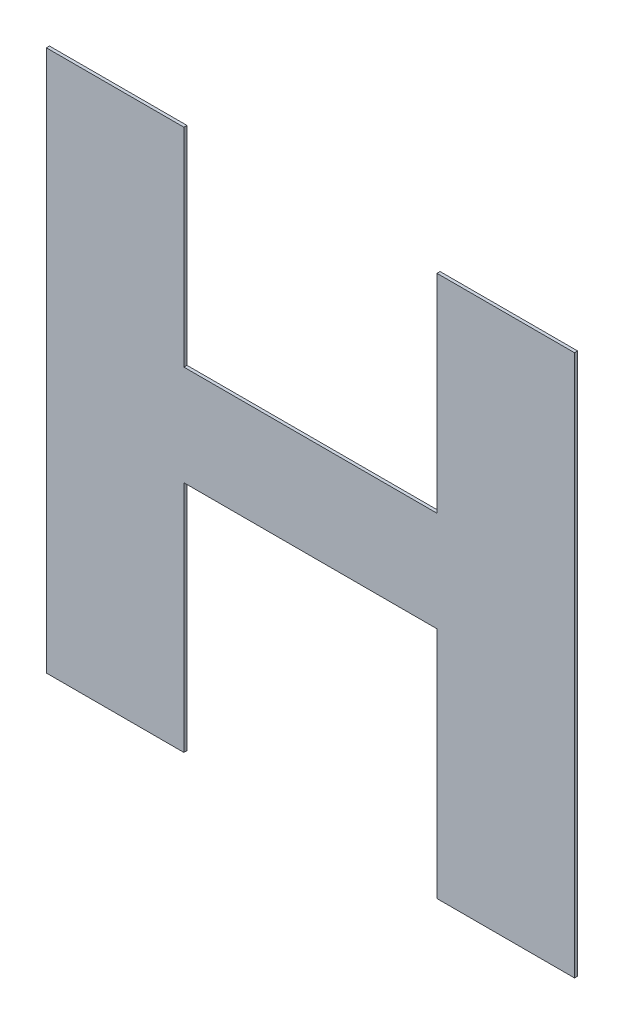
ISO-10303-21;
HEADER;
FILE_DESCRIPTION(('STEP AP214'),'2;1');
FILE_NAME('part.step','',(''),(''),'','','');
FILE_SCHEMA(('AUTOMOTIVE_DESIGN { 1 0 10303 214 1 1 1 1 }'));
ENDSEC;
DATA;
#1=APPLICATION_CONTEXT('core data for automotive mechanical design processes');
#2=APPLICATION_PROTOCOL_DEFINITION('international standard','automotive_design',2000,#1);
#3=PRODUCT_CONTEXT('',#1,'mechanical');
#4=PRODUCT('Part','Part','',(#3));
#5=PRODUCT_RELATED_PRODUCT_CATEGORY('part','',(#4));
#6=PRODUCT_DEFINITION_FORMATION('','',#4);
#7=PRODUCT_DEFINITION_CONTEXT('part definition',#1,'design');
#8=PRODUCT_DEFINITION('design','',#6,#7);
#9=PRODUCT_DEFINITION_SHAPE('','',#8);
#10=(LENGTH_UNIT() NAMED_UNIT(*) SI_UNIT(.MILLI.,.METRE.));
#11=(NAMED_UNIT(*) PLANE_ANGLE_UNIT() SI_UNIT($,.RADIAN.));
#12=(NAMED_UNIT(*) SI_UNIT($,.STERADIAN.) SOLID_ANGLE_UNIT());
#13=UNCERTAINTY_MEASURE_WITH_UNIT(LENGTH_MEASURE(1.E-05),#10,'distance_accuracy_value','');
#14=(GEOMETRIC_REPRESENTATION_CONTEXT(3) GLOBAL_UNCERTAINTY_ASSIGNED_CONTEXT((#13)) GLOBAL_UNIT_ASSIGNED_CONTEXT((#10,
#11,#12)) REPRESENTATION_CONTEXT('',''));
#15=CARTESIAN_POINT('',(0.,0.,0.));
#16=DIRECTION('',(0.,0.,1.));
#17=DIRECTION('',(1.,0.,0.));
#18=AXIS2_PLACEMENT_3D('',#15,#16,#17);
#19=CARTESIAN_POINT('',(-0.0483721960073377,0.92595557828035,0.00015));
#20=DIRECTION('',(0.,1.,0.));
#21=DIRECTION('',(0.,0.,1.));
#22=AXIS2_PLACEMENT_3D('',#19,#20,#21);
#23=PLANE('',#22);
#24=DIRECTION('',(0.,0.,1.));
#25=VECTOR('',#24,1.);
#26=CARTESIAN_POINT('',(-0.0517065037490002,0.92595557828035,0.));
#27=LINE('',#26,#25);
#28=CARTESIAN_POINT('',(-0.0517065037490002,0.92595557828035,0.));
#29=VERTEX_POINT('',#28);
#30=CARTESIAN_POINT('',(-0.0517065037490002,0.92595557828035,0.00015));
#31=VERTEX_POINT('',#30);
#32=EDGE_CURVE('E11',#29,#31,#27,.T.);
#33=ORIENTED_EDGE('',*,*,#32,.T.);
#34=DIRECTION('',(1.,0.,0.));
#35=VECTOR('',#34,1.);
#36=CARTESIAN_POINT('',(-0.0517065037490002,0.92595557828035,0.00015));
#37=LINE('',#36,#35);
#38=CARTESIAN_POINT('',(-0.0450378882656752,0.92595557828035,0.00015));
#39=VERTEX_POINT('',#38);
#40=EDGE_CURVE('E24',#31,#39,#37,.T.);
#41=ORIENTED_EDGE('',*,*,#40,.T.);
#42=DIRECTION('',(0.,0.,1.));
#43=VECTOR('',#42,1.);
#44=CARTESIAN_POINT('',(-0.0450378882656752,0.92595557828035,0.));
#45=LINE('',#44,#43);
#46=CARTESIAN_POINT('',(-0.0450378882656752,0.92595557828035,0.));
#47=VERTEX_POINT('',#46);
#48=EDGE_CURVE('E197',#47,#39,#45,.T.);
#49=ORIENTED_EDGE('',*,*,#48,.F.);
#50=DIRECTION('',(1.,0.,0.));
#51=VECTOR('',#50,1.);
#52=CARTESIAN_POINT('',(-0.0517065037490002,0.92595557828035,0.));
#53=LINE('',#52,#51);
#54=EDGE_CURVE('E195',#29,#47,#53,.T.);
#55=ORIENTED_EDGE('',*,*,#54,.F.);
#56=EDGE_LOOP('',(#33,#41,#49,#55));
#57=FACE_BOUND('',#56,.T.);
#58=ADVANCED_FACE('F17',(#57),#23,.T.);
#59=CARTESIAN_POINT('',(-0.0450378882656752,0.920917038594508,0.00015));
#60=DIRECTION('',(1.,0.,0.));
#61=DIRECTION('',(0.,0.,-1.));
#62=AXIS2_PLACEMENT_3D('',#59,#60,#61);
#63=PLANE('',#62);
#64=ORIENTED_EDGE('',*,*,#48,.T.);
#65=DIRECTION('',(0.,-1.,0.));
#66=VECTOR('',#65,1.);
#67=CARTESIAN_POINT('',(-0.0450378882656752,0.92595557828035,0.00015));
#68=LINE('',#67,#66);
#69=CARTESIAN_POINT('',(-0.0450378882656752,0.915878498908667,0.00015));
#70=VERTEX_POINT('',#69);
#71=EDGE_CURVE('E193',#39,#70,#68,.T.);
#72=ORIENTED_EDGE('',*,*,#71,.T.);
#73=DIRECTION('',(0.,0.,1.));
#74=VECTOR('',#73,1.);
#75=CARTESIAN_POINT('',(-0.0450378882656752,0.915878498908667,0.));
#76=LINE('',#75,#74);
#77=CARTESIAN_POINT('',(-0.0450378882656752,0.915878498908667,0.));
#78=VERTEX_POINT('',#77);
#79=EDGE_CURVE('E190',#78,#70,#76,.T.);
#80=ORIENTED_EDGE('',*,*,#79,.F.);
#81=DIRECTION('',(0.,-1.,0.));
#82=VECTOR('',#81,1.);
#83=CARTESIAN_POINT('',(-0.0450378882656752,0.92595557828035,0.));
#84=LINE('',#83,#82);
#85=EDGE_CURVE('E187',#47,#78,#84,.T.);
#86=ORIENTED_EDGE('',*,*,#85,.F.);
#87=EDGE_LOOP('',(#64,#72,#80,#86));
#88=FACE_BOUND('',#87,.T.);
#89=ADVANCED_FACE('F203',(#88),#63,.T.);
#90=CARTESIAN_POINT('',(-0.0388988606656627,0.915878498908667,0.00015));
#91=DIRECTION('',(0.,1.,0.));
#92=DIRECTION('',(0.,0.,1.));
#93=AXIS2_PLACEMENT_3D('',#90,#91,#92);
#94=PLANE('',#93);
#95=ORIENTED_EDGE('',*,*,#79,.T.);
#96=DIRECTION('',(1.,0.,0.));
#97=VECTOR('',#96,1.);
#98=CARTESIAN_POINT('',(-0.0450378882656752,0.915878498908667,0.00015));
#99=LINE('',#98,#97);
#100=CARTESIAN_POINT('',(-0.0327598330656502,0.915878498908667,0.00015));
#101=VERTEX_POINT('',#100);
#102=EDGE_CURVE('E185',#70,#101,#99,.T.);
#103=ORIENTED_EDGE('',*,*,#102,.T.);
#104=DIRECTION('',(0.,0.,1.));
#105=VECTOR('',#104,1.);
#106=CARTESIAN_POINT('',(-0.0327598330656502,0.915878498908667,0.));
#107=LINE('',#106,#105);
#108=CARTESIAN_POINT('',(-0.0327598330656502,0.915878498908667,0.));
#109=VERTEX_POINT('',#108);
#110=EDGE_CURVE('E182',#109,#101,#107,.T.);
#111=ORIENTED_EDGE('',*,*,#110,.F.);
#112=DIRECTION('',(1.,0.,0.));
#113=VECTOR('',#112,1.);
#114=CARTESIAN_POINT('',(-0.0450378882656752,0.915878498908667,0.));
#115=LINE('',#114,#113);
#116=EDGE_CURVE('E179',#78,#109,#115,.T.);
#117=ORIENTED_EDGE('',*,*,#116,.F.);
#118=EDGE_LOOP('',(#95,#103,#111,#117));
#119=FACE_BOUND('',#118,.T.);
#120=ADVANCED_FACE('F209',(#119),#94,.T.);
#121=CARTESIAN_POINT('',(-0.0327598330656502,0.920917038594508,0.00015));
#122=DIRECTION('',(-1.,0.,0.));
#123=DIRECTION('',(0.,0.,1.));
#124=AXIS2_PLACEMENT_3D('',#121,#122,#123);
#125=PLANE('',#124);
#126=ORIENTED_EDGE('',*,*,#110,.T.);
#127=DIRECTION('',(0.,1.,0.));
#128=VECTOR('',#127,1.);
#129=CARTESIAN_POINT('',(-0.0327598330656502,0.915878498908667,0.00015));
#130=LINE('',#129,#128);
#131=CARTESIAN_POINT('',(-0.0327598330656502,0.92595557828035,0.00015));
#132=VERTEX_POINT('',#131);
#133=EDGE_CURVE('E177',#101,#132,#130,.T.);
#134=ORIENTED_EDGE('',*,*,#133,.T.);
#135=DIRECTION('',(0.,0.,1.));
#136=VECTOR('',#135,1.);
#137=CARTESIAN_POINT('',(-0.0327598330656502,0.92595557828035,0.));
#138=LINE('',#137,#136);
#139=CARTESIAN_POINT('',(-0.0327598330656502,0.92595557828035,0.));
#140=VERTEX_POINT('',#139);
#141=EDGE_CURVE('E174',#140,#132,#138,.T.);
#142=ORIENTED_EDGE('',*,*,#141,.F.);
#143=DIRECTION('',(0.,1.,0.));
#144=VECTOR('',#143,1.);
#145=CARTESIAN_POINT('',(-0.0327598330656502,0.915878498908667,0.));
#146=LINE('',#145,#144);
#147=EDGE_CURVE('E171',#109,#140,#146,.T.);
#148=ORIENTED_EDGE('',*,*,#147,.F.);
#149=EDGE_LOOP('',(#126,#134,#142,#148));
#150=FACE_BOUND('',#149,.T.);
#151=ADVANCED_FACE('F213',(#150),#125,.T.);
#152=CARTESIAN_POINT('',(-0.0294245093240002,0.92595557828035,0.00015));
#153=DIRECTION('',(0.,1.,0.));
#154=DIRECTION('',(0.,0.,1.));
#155=AXIS2_PLACEMENT_3D('',#152,#153,#154);
#156=PLANE('',#155);
#157=ORIENTED_EDGE('',*,*,#141,.T.);
#158=DIRECTION('',(1.,0.,0.));
#159=VECTOR('',#158,1.);
#160=CARTESIAN_POINT('',(-0.0327598330656502,0.92595557828035,0.00015));
#161=LINE('',#160,#159);
#162=CARTESIAN_POINT('',(-0.0260891855823502,0.92595557828035,0.00015));
#163=VERTEX_POINT('',#162);
#164=EDGE_CURVE('E169',#132,#163,#161,.T.);
#165=ORIENTED_EDGE('',*,*,#164,.T.);
#166=DIRECTION('',(0.,0.,1.));
#167=VECTOR('',#166,1.);
#168=CARTESIAN_POINT('',(-0.0260891855823502,0.92595557828035,0.));
#169=LINE('',#168,#167);
#170=CARTESIAN_POINT('',(-0.0260891855823502,0.92595557828035,0.));
#171=VERTEX_POINT('',#170);
#172=EDGE_CURVE('E166',#171,#163,#169,.T.);
#173=ORIENTED_EDGE('',*,*,#172,.F.);
#174=DIRECTION('',(1.,0.,0.));
#175=VECTOR('',#174,1.);
#176=CARTESIAN_POINT('',(-0.0327598330656502,0.92595557828035,0.));
#177=LINE('',#176,#175);
#178=EDGE_CURVE('E163',#140,#171,#177,.T.);
#179=ORIENTED_EDGE('',*,*,#178,.F.);
#180=EDGE_LOOP('',(#157,#165,#173,#179));
#181=FACE_BOUND('',#180,.T.);
#182=ADVANCED_FACE('F217',(#181),#156,.T.);
#183=CARTESIAN_POINT('',(-0.0260891855823502,0.9128238842195,0.00015));
#184=DIRECTION('',(1.,0.,0.));
#185=DIRECTION('',(0.,0.,-1.));
#186=AXIS2_PLACEMENT_3D('',#183,#184,#185);
#187=PLANE('',#186);
#188=ORIENTED_EDGE('',*,*,#172,.T.);
#189=DIRECTION('',(0.,-1.,0.));
#190=VECTOR('',#189,1.);
#191=CARTESIAN_POINT('',(-0.0260891855823502,0.92595557828035,0.00015));
#192=LINE('',#191,#190);
#193=CARTESIAN_POINT('',(-0.0260891855823502,0.89969219015865,0.00015));
#194=VERTEX_POINT('',#193);
#195=EDGE_CURVE('E161',#163,#194,#192,.T.);
#196=ORIENTED_EDGE('',*,*,#195,.T.);
#197=DIRECTION('',(0.,0.,1.));
#198=VECTOR('',#197,1.);
#199=CARTESIAN_POINT('',(-0.0260891855823502,0.89969219015865,0.));
#200=LINE('',#199,#198);
#201=CARTESIAN_POINT('',(-0.0260891855823502,0.89969219015865,0.));
#202=VERTEX_POINT('',#201);
#203=EDGE_CURVE('E158',#202,#194,#200,.T.);
#204=ORIENTED_EDGE('',*,*,#203,.F.);
#205=DIRECTION('',(0.,-1.,0.));
#206=VECTOR('',#205,1.);
#207=CARTESIAN_POINT('',(-0.0260891855823502,0.92595557828035,0.));
#208=LINE('',#207,#206);
#209=EDGE_CURVE('E155',#171,#202,#208,.T.);
#210=ORIENTED_EDGE('',*,*,#209,.F.);
#211=EDGE_LOOP('',(#188,#196,#204,#210));
#212=FACE_BOUND('',#211,.T.);
#213=ADVANCED_FACE('F220',(#212),#187,.T.);
#214=CARTESIAN_POINT('',(-0.0294245093240002,0.89969219015865,0.00015));
#215=DIRECTION('',(0.,-1.,0.));
#216=DIRECTION('',(0.,0.,-1.));
#217=AXIS2_PLACEMENT_3D('',#214,#215,#216);
#218=PLANE('',#217);
#219=ORIENTED_EDGE('',*,*,#203,.T.);
#220=DIRECTION('',(-1.,0.,0.));
#221=VECTOR('',#220,1.);
#222=CARTESIAN_POINT('',(-0.0260891855823502,0.89969219015865,0.00015));
#223=LINE('',#222,#221);
#224=CARTESIAN_POINT('',(-0.0327598330656502,0.89969219015865,0.00015));
#225=VERTEX_POINT('',#224);
#226=EDGE_CURVE('E153',#194,#225,#223,.T.);
#227=ORIENTED_EDGE('',*,*,#226,.T.);
#228=DIRECTION('',(0.,0.,1.));
#229=VECTOR('',#228,1.);
#230=CARTESIAN_POINT('',(-0.0327598330656502,0.89969219015865,0.));
#231=LINE('',#230,#229);
#232=CARTESIAN_POINT('',(-0.0327598330656502,0.89969219015865,0.));
#233=VERTEX_POINT('',#232);
#234=EDGE_CURVE('E150',#233,#225,#231,.T.);
#235=ORIENTED_EDGE('',*,*,#234,.F.);
#236=DIRECTION('',(-1.,0.,0.));
#237=VECTOR('',#236,1.);
#238=CARTESIAN_POINT('',(-0.0260891855823502,0.89969219015865,0.));
#239=LINE('',#238,#237);
#240=EDGE_CURVE('E147',#202,#233,#239,.T.);
#241=ORIENTED_EDGE('',*,*,#240,.F.);
#242=EDGE_LOOP('',(#219,#227,#235,#241));
#243=FACE_BOUND('',#242,.T.);
#244=ADVANCED_FACE('F225',(#243),#218,.T.);
#245=CARTESIAN_POINT('',(-0.0327598330656502,0.905357499715325,0.00015));
#246=DIRECTION('',(-1.,0.,0.));
#247=DIRECTION('',(0.,0.,1.));
#248=AXIS2_PLACEMENT_3D('',#245,#246,#247);
#249=PLANE('',#248);
#250=ORIENTED_EDGE('',*,*,#234,.T.);
#251=DIRECTION('',(0.,1.,0.));
#252=VECTOR('',#251,1.);
#253=CARTESIAN_POINT('',(-0.0327598330656502,0.89969219015865,0.00015));
#254=LINE('',#253,#252);
#255=CARTESIAN_POINT('',(-0.0327598330656502,0.911022809272,0.00015));
#256=VERTEX_POINT('',#255);
#257=EDGE_CURVE('E145',#225,#256,#254,.T.);
#258=ORIENTED_EDGE('',*,*,#257,.T.);
#259=DIRECTION('',(0.,0.,1.));
#260=VECTOR('',#259,1.);
#261=CARTESIAN_POINT('',(-0.0327598330656502,0.911022809272,0.));
#262=LINE('',#261,#260);
#263=CARTESIAN_POINT('',(-0.0327598330656502,0.911022809272,0.));
#264=VERTEX_POINT('',#263);
#265=EDGE_CURVE('E142',#264,#256,#262,.T.);
#266=ORIENTED_EDGE('',*,*,#265,.F.);
#267=DIRECTION('',(0.,1.,0.));
#268=VECTOR('',#267,1.);
#269=CARTESIAN_POINT('',(-0.0327598330656502,0.89969219015865,0.));
#270=LINE('',#269,#268);
#271=EDGE_CURVE('E139',#233,#264,#270,.T.);
#272=ORIENTED_EDGE('',*,*,#271,.F.);
#273=EDGE_LOOP('',(#250,#258,#266,#272));
#274=FACE_BOUND('',#273,.T.);
#275=ADVANCED_FACE('F229',(#274),#249,.T.);
#276=CARTESIAN_POINT('',(-0.0388988606656627,0.911022809272,0.00015));
#277=DIRECTION('',(0.,-1.,0.));
#278=DIRECTION('',(0.,0.,-1.));
#279=AXIS2_PLACEMENT_3D('',#276,#277,#278);
#280=PLANE('',#279);
#281=ORIENTED_EDGE('',*,*,#265,.T.);
#282=DIRECTION('',(-1.,0.,0.));
#283=VECTOR('',#282,1.);
#284=CARTESIAN_POINT('',(-0.0327598330656502,0.911022809272,0.00015));
#285=LINE('',#284,#283);
#286=CARTESIAN_POINT('',(-0.0450378882656752,0.911022809272,0.00015));
#287=VERTEX_POINT('',#286);
#288=EDGE_CURVE('E137',#256,#287,#285,.T.);
#289=ORIENTED_EDGE('',*,*,#288,.T.);
#290=DIRECTION('',(0.,0.,1.));
#291=VECTOR('',#290,1.);
#292=CARTESIAN_POINT('',(-0.0450378882656752,0.911022809272,0.));
#293=LINE('',#292,#291);
#294=CARTESIAN_POINT('',(-0.0450378882656752,0.911022809272,0.));
#295=VERTEX_POINT('',#294);
#296=EDGE_CURVE('E134',#295,#287,#293,.T.);
#297=ORIENTED_EDGE('',*,*,#296,.F.);
#298=DIRECTION('',(-1.,0.,0.));
#299=VECTOR('',#298,1.);
#300=CARTESIAN_POINT('',(-0.0327598330656502,0.911022809272,0.));
#301=LINE('',#300,#299);
#302=EDGE_CURVE('E132',#264,#295,#301,.T.);
#303=ORIENTED_EDGE('',*,*,#302,.F.);
#304=EDGE_LOOP('',(#281,#289,#297,#303));
#305=FACE_BOUND('',#304,.T.);
#306=ADVANCED_FACE('F232',(#305),#280,.T.);
#307=CARTESIAN_POINT('',(-0.0450378882656752,0.905357499715325,0.00015));
#308=DIRECTION('',(1.,0.,0.));
#309=DIRECTION('',(0.,0.,-1.));
#310=AXIS2_PLACEMENT_3D('',#307,#308,#309);
#311=PLANE('',#310);
#312=ORIENTED_EDGE('',*,*,#296,.T.);
#313=DIRECTION('',(0.,-1.,0.));
#314=VECTOR('',#313,1.);
#315=CARTESIAN_POINT('',(-0.0450378882656752,0.911022809272,0.00015));
#316=LINE('',#315,#314);
#317=CARTESIAN_POINT('',(-0.0450378882656752,0.89969219015865,0.00015));
#318=VERTEX_POINT('',#317);
#319=EDGE_CURVE('E130',#287,#318,#316,.T.);
#320=ORIENTED_EDGE('',*,*,#319,.T.);
#321=DIRECTION('',(0.,0.,1.));
#322=VECTOR('',#321,1.);
#323=CARTESIAN_POINT('',(-0.0450378882656752,0.89969219015865,0.));
#324=LINE('',#323,#322);
#325=CARTESIAN_POINT('',(-0.0450378882656752,0.89969219015865,0.));
#326=VERTEX_POINT('',#325);
#327=EDGE_CURVE('E128',#326,#318,#324,.T.);
#328=ORIENTED_EDGE('',*,*,#327,.F.);
#329=DIRECTION('',(0.,-1.,0.));
#330=VECTOR('',#329,1.);
#331=CARTESIAN_POINT('',(-0.0450378882656752,0.911022809272,0.));
#332=LINE('',#331,#330);
#333=EDGE_CURVE('E119',#295,#326,#332,.T.);
#334=ORIENTED_EDGE('',*,*,#333,.F.);
#335=EDGE_LOOP('',(#312,#320,#328,#334));
#336=FACE_BOUND('',#335,.T.);
#337=ADVANCED_FACE('F235',(#336),#311,.T.);
#338=CARTESIAN_POINT('',(-0.0483721960073377,0.89969219015865,0.00015));
#339=DIRECTION('',(0.,-1.,0.));
#340=DIRECTION('',(0.,0.,-1.));
#341=AXIS2_PLACEMENT_3D('',#338,#339,#340);
#342=PLANE('',#341);
#343=ORIENTED_EDGE('',*,*,#327,.T.);
#344=DIRECTION('',(-1.,0.,0.));
#345=VECTOR('',#344,1.);
#346=CARTESIAN_POINT('',(-0.0450378882656752,0.89969219015865,0.00015));
#347=LINE('',#346,#345);
#348=CARTESIAN_POINT('',(-0.0517065037490002,0.89969219015865,0.00015));
#349=VERTEX_POINT('',#348);
#350=EDGE_CURVE('E108',#318,#349,#347,.T.);
#351=ORIENTED_EDGE('',*,*,#350,.T.);
#352=DIRECTION('',(0.,0.,1.));
#353=VECTOR('',#352,1.);
#354=CARTESIAN_POINT('',(-0.0517065037490002,0.89969219015865,0.));
#355=LINE('',#354,#353);
#356=CARTESIAN_POINT('',(-0.0517065037490002,0.89969219015865,0.));
#357=VERTEX_POINT('',#356);
#358=EDGE_CURVE('E102',#357,#349,#355,.T.);
#359=ORIENTED_EDGE('',*,*,#358,.F.);
#360=DIRECTION('',(-1.,0.,0.));
#361=VECTOR('',#360,1.);
#362=CARTESIAN_POINT('',(-0.0450378882656752,0.89969219015865,0.));
#363=LINE('',#362,#361);
#364=EDGE_CURVE('E106',#326,#357,#363,.T.);
#365=ORIENTED_EDGE('',*,*,#364,.F.);
#366=EDGE_LOOP('',(#343,#351,#359,#365));
#367=FACE_BOUND('',#366,.T.);
#368=ADVANCED_FACE('F105',(#367),#342,.T.);
#369=CARTESIAN_POINT('',(-0.0517065037490002,0.9128238842195,0.00015));
#370=DIRECTION('',(-1.,0.,0.));
#371=DIRECTION('',(0.,0.,1.));
#372=AXIS2_PLACEMENT_3D('',#369,#370,#371);
#373=PLANE('',#372);
#374=ORIENTED_EDGE('',*,*,#358,.T.);
#375=DIRECTION('',(0.,1.,0.));
#376=VECTOR('',#375,1.);
#377=CARTESIAN_POINT('',(-0.0517065037490002,0.89969219015865,0.00015));
#378=LINE('',#377,#376);
#379=EDGE_CURVE('E120',#349,#31,#378,.T.);
#380=ORIENTED_EDGE('',*,*,#379,.T.);
#381=ORIENTED_EDGE('',*,*,#32,.F.);
#382=DIRECTION('',(0.,1.,0.));
#383=VECTOR('',#382,1.);
#384=CARTESIAN_POINT('',(-0.0517065037490002,0.89969219015865,0.));
#385=LINE('',#384,#383);
#386=EDGE_CURVE('E116',#357,#29,#385,.T.);
#387=ORIENTED_EDGE('',*,*,#386,.F.);
#388=EDGE_LOOP('',(#374,#380,#381,#387));
#389=FACE_BOUND('',#388,.T.);
#390=ADVANCED_FACE('F122',(#389),#373,.T.);
#391=CARTESIAN_POINT('',(-0.0388978446656752,0.89969219015865,0.));
#392=DIRECTION('',(0.,0.,1.));
#393=DIRECTION('',(1.,0.,0.));
#394=AXIS2_PLACEMENT_3D('',#391,#392,#393);
#395=PLANE('',#394);
#396=ORIENTED_EDGE('',*,*,#54,.T.);
#397=ORIENTED_EDGE('',*,*,#85,.T.);
#398=ORIENTED_EDGE('',*,*,#116,.T.);
#399=ORIENTED_EDGE('',*,*,#147,.T.);
#400=ORIENTED_EDGE('',*,*,#178,.T.);
#401=ORIENTED_EDGE('',*,*,#209,.T.);
#402=ORIENTED_EDGE('',*,*,#240,.T.);
#403=ORIENTED_EDGE('',*,*,#271,.T.);
#404=ORIENTED_EDGE('',*,*,#302,.T.);
#405=ORIENTED_EDGE('',*,*,#333,.T.);
#406=ORIENTED_EDGE('',*,*,#364,.T.);
#407=ORIENTED_EDGE('',*,*,#386,.T.);
#408=EDGE_LOOP('',(#396,#397,#398,#399,#400,#401,#402,#403,#404,#405,#406,#407));
#409=FACE_BOUND('',#408,.T.);
#410=ADVANCED_FACE('F115',(#409),#395,.F.);
#411=CARTESIAN_POINT('',(-0.0388978446656752,0.89969219015865,0.00015));
#412=DIRECTION('',(0.,0.,1.));
#413=DIRECTION('',(1.,0.,0.));
#414=AXIS2_PLACEMENT_3D('',#411,#412,#413);
#415=PLANE('',#414);
#416=ORIENTED_EDGE('',*,*,#40,.F.);
#417=ORIENTED_EDGE('',*,*,#379,.F.);
#418=ORIENTED_EDGE('',*,*,#350,.F.);
#419=ORIENTED_EDGE('',*,*,#319,.F.);
#420=ORIENTED_EDGE('',*,*,#288,.F.);
#421=ORIENTED_EDGE('',*,*,#257,.F.);
#422=ORIENTED_EDGE('',*,*,#226,.F.);
#423=ORIENTED_EDGE('',*,*,#195,.F.);
#424=ORIENTED_EDGE('',*,*,#164,.F.);
#425=ORIENTED_EDGE('',*,*,#133,.F.);
#426=ORIENTED_EDGE('',*,*,#102,.F.);
#427=ORIENTED_EDGE('',*,*,#71,.F.);
#428=EDGE_LOOP('',(#416,#417,#418,#419,#420,#421,#422,#423,#424,#425,#426,#427));
#429=FACE_BOUND('',#428,.T.);
#430=ADVANCED_FACE('F205',(#429),#415,.T.);
#431=CLOSED_SHELL('',(#58,#89,#120,#151,#182,#213,#244,#275,#306,#337,#368,#390,#410,#430));
#432=MANIFOLD_SOLID_BREP('B1',#431);
#433=ADVANCED_BREP_SHAPE_REPRESENTATION('',(#18,#432),#14);
#434=SHAPE_DEFINITION_REPRESENTATION(#9,#433);
ENDSEC;
END-ISO-10303-21;
